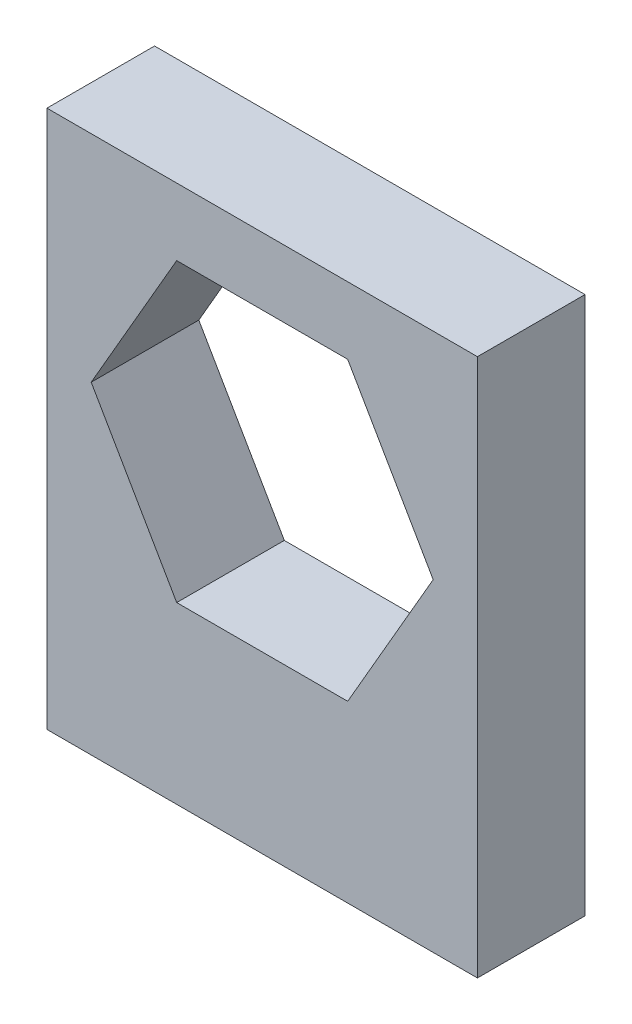
ISO-10303-21;
HEADER;
FILE_DESCRIPTION(('STEP AP214'),'2;1');
FILE_NAME('part.step','',(''),(''),'','','');
FILE_SCHEMA(('AUTOMOTIVE_DESIGN { 1 0 10303 214 1 1 1 1 }'));
ENDSEC;
DATA;
#1=APPLICATION_CONTEXT('core data for automotive mechanical design processes');
#2=APPLICATION_PROTOCOL_DEFINITION('international standard','automotive_design',2000,#1);
#3=PRODUCT_CONTEXT('',#1,'mechanical');
#4=PRODUCT('Part','Part','',(#3));
#5=PRODUCT_RELATED_PRODUCT_CATEGORY('part','',(#4));
#6=PRODUCT_DEFINITION_FORMATION('','',#4);
#7=PRODUCT_DEFINITION_CONTEXT('part definition',#1,'design');
#8=PRODUCT_DEFINITION('design','',#6,#7);
#9=PRODUCT_DEFINITION_SHAPE('','',#8);
#10=(LENGTH_UNIT() NAMED_UNIT(*) SI_UNIT(.MILLI.,.METRE.));
#11=(NAMED_UNIT(*) PLANE_ANGLE_UNIT() SI_UNIT($,.RADIAN.));
#12=(NAMED_UNIT(*) SI_UNIT($,.STERADIAN.) SOLID_ANGLE_UNIT());
#13=UNCERTAINTY_MEASURE_WITH_UNIT(LENGTH_MEASURE(1.E-05),#10,'distance_accuracy_value','');
#14=(GEOMETRIC_REPRESENTATION_CONTEXT(3) GLOBAL_UNCERTAINTY_ASSIGNED_CONTEXT((#13)) GLOBAL_UNIT_ASSIGNED_CONTEXT((#10,
#11,#12)) REPRESENTATION_CONTEXT('',''));
#15=CARTESIAN_POINT('',(0.,0.,0.));
#16=DIRECTION('',(0.,0.,1.));
#17=DIRECTION('',(1.,0.,0.));
#18=AXIS2_PLACEMENT_3D('',#15,#16,#17);
#19=CARTESIAN_POINT('',(0.,0.,1.5875));
#20=DIRECTION('',(0.,0.,1.));
#21=DIRECTION('',(1.,0.,0.));
#22=AXIS2_PLACEMENT_3D('',#19,#20,#21);
#23=PLANE('',#22);
#24=DIRECTION('',(0.,-1.,0.));
#25=VECTOR('',#24,1.);
#26=CARTESIAN_POINT('',(-6.35,6.35,1.5875));
#27=LINE('',#26,#25);
#28=CARTESIAN_POINT('',(-6.35,6.35,1.5875));
#29=VERTEX_POINT('',#28);
#30=CARTESIAN_POINT('',(-6.35,-9.525,1.5875));
#31=VERTEX_POINT('',#30);
#32=EDGE_CURVE('E161',#29,#31,#27,.T.);
#33=ORIENTED_EDGE('',*,*,#32,.T.);
#34=DIRECTION('',(1.,0.,0.));
#35=VECTOR('',#34,1.);
#36=CARTESIAN_POINT('',(-6.35,-9.525,1.5875));
#37=LINE('',#36,#35);
#38=CARTESIAN_POINT('',(6.35,-9.525,1.5875));
#39=VERTEX_POINT('',#38);
#40=EDGE_CURVE('E164',#31,#39,#37,.T.);
#41=ORIENTED_EDGE('',*,*,#40,.T.);
#42=DIRECTION('',(0.,1.,0.));
#43=VECTOR('',#42,1.);
#44=CARTESIAN_POINT('',(6.35,6.35,1.5875));
#45=LINE('',#44,#43);
#46=CARTESIAN_POINT('',(6.35,6.35,1.5875));
#47=VERTEX_POINT('',#46);
#48=EDGE_CURVE('E167',#39,#47,#45,.T.);
#49=ORIENTED_EDGE('',*,*,#48,.T.);
#50=DIRECTION('',(-1.,0.,0.));
#51=VECTOR('',#50,1.);
#52=CARTESIAN_POINT('',(-6.35,6.35,1.5875));
#53=LINE('',#52,#51);
#54=EDGE_CURVE('E169',#47,#29,#53,.T.);
#55=ORIENTED_EDGE('',*,*,#54,.T.);
#56=EDGE_LOOP('',(#33,#41,#49,#55));
#57=FACE_BOUND('',#56,.T.);
#58=DIRECTION('',(-1.,0.,0.));
#59=VECTOR('',#58,1.);
#60=CARTESIAN_POINT('',(2.52232785603563,4.3688,1.5875));
#61=LINE('',#60,#59);
#62=CARTESIAN_POINT('',(2.52232785603563,4.3688,1.5875));
#63=VERTEX_POINT('',#62);
#64=CARTESIAN_POINT('',(-2.52232785603564,4.3688,1.5875));
#65=VERTEX_POINT('',#64);
#66=EDGE_CURVE('E118',#63,#65,#61,.T.);
#67=ORIENTED_EDGE('',*,*,#66,.F.);
#68=DIRECTION('',(-0.5,0.866025403784438,0.));
#69=VECTOR('',#68,1.);
#70=CARTESIAN_POINT('',(5.04465571207127,0.,1.5875));
#71=LINE('',#70,#69);
#72=CARTESIAN_POINT('',(5.04465571207127,0.,1.5875));
#73=VERTEX_POINT('',#72);
#74=EDGE_CURVE('E110',#73,#63,#71,.T.);
#75=ORIENTED_EDGE('',*,*,#74,.F.);
#76=DIRECTION('',(0.5,0.866025403784439,0.));
#77=VECTOR('',#76,1.);
#78=CARTESIAN_POINT('',(2.52232785603564,-4.3688,1.5875));
#79=LINE('',#78,#77);
#80=CARTESIAN_POINT('',(2.52232785603564,-4.3688,1.5875));
#81=VERTEX_POINT('',#80);
#82=EDGE_CURVE('E139',#81,#73,#79,.T.);
#83=ORIENTED_EDGE('',*,*,#82,.F.);
#84=DIRECTION('',(1.,0.,0.));
#85=VECTOR('',#84,1.);
#86=CARTESIAN_POINT('',(-2.52232785603563,-4.3688,1.5875));
#87=LINE('',#86,#85);
#88=CARTESIAN_POINT('',(-2.52232785603563,-4.3688,1.5875));
#89=VERTEX_POINT('',#88);
#90=EDGE_CURVE('E137',#89,#81,#87,.T.);
#91=ORIENTED_EDGE('',*,*,#90,.F.);
#92=DIRECTION('',(0.5,-0.866025403784438,0.));
#93=VECTOR('',#92,1.);
#94=CARTESIAN_POINT('',(-5.04465571207127,0.,1.5875));
#95=LINE('',#94,#93);
#96=CARTESIAN_POINT('',(-5.04465571207127,0.,1.5875));
#97=VERTEX_POINT('',#96);
#98=EDGE_CURVE('E133',#97,#89,#95,.T.);
#99=ORIENTED_EDGE('',*,*,#98,.F.);
#100=DIRECTION('',(-0.499999999999999,-0.866025403784439,0.));
#101=VECTOR('',#100,1.);
#102=CARTESIAN_POINT('',(-2.52232785603564,4.3688,1.5875));
#103=LINE('',#102,#101);
#104=EDGE_CURVE('E131',#65,#97,#103,.T.);
#105=ORIENTED_EDGE('',*,*,#104,.F.);
#106=EDGE_LOOP('',(#67,#75,#83,#91,#99,#105));
#107=FACE_BOUND('',#106,.T.);
#108=ADVANCED_FACE('F33',(#57,#107),#23,.T.);
#109=CARTESIAN_POINT('',(0.,0.,-1.5875));
#110=DIRECTION('',(0.,0.,1.));
#111=DIRECTION('',(1.,0.,0.));
#112=AXIS2_PLACEMENT_3D('',#109,#110,#111);
#113=PLANE('',#112);
#114=DIRECTION('',(0.,-1.,0.));
#115=VECTOR('',#114,1.);
#116=CARTESIAN_POINT('',(-6.35,6.35,-1.5875));
#117=LINE('',#116,#115);
#118=CARTESIAN_POINT('',(-6.35,6.35,-1.5875));
#119=VERTEX_POINT('',#118);
#120=CARTESIAN_POINT('',(-6.35,-9.525,-1.5875));
#121=VERTEX_POINT('',#120);
#122=EDGE_CURVE('E126',#119,#121,#117,.T.);
#123=ORIENTED_EDGE('',*,*,#122,.F.);
#124=DIRECTION('',(-1.,0.,0.));
#125=VECTOR('',#124,1.);
#126=CARTESIAN_POINT('',(-6.35,6.35,-1.5875));
#127=LINE('',#126,#125);
#128=CARTESIAN_POINT('',(6.35,6.35,-1.5875));
#129=VERTEX_POINT('',#128);
#130=EDGE_CURVE('E165',#129,#119,#127,.T.);
#131=ORIENTED_EDGE('',*,*,#130,.F.);
#132=DIRECTION('',(0.,1.,0.));
#133=VECTOR('',#132,1.);
#134=CARTESIAN_POINT('',(6.35,6.35,-1.5875));
#135=LINE('',#134,#133);
#136=CARTESIAN_POINT('',(6.35,-9.525,-1.5875));
#137=VERTEX_POINT('',#136);
#138=EDGE_CURVE('E176',#137,#129,#135,.T.);
#139=ORIENTED_EDGE('',*,*,#138,.F.);
#140=DIRECTION('',(1.,0.,0.));
#141=VECTOR('',#140,1.);
#142=CARTESIAN_POINT('',(-6.35,-9.525,-1.5875));
#143=LINE('',#142,#141);
#144=EDGE_CURVE('E174',#121,#137,#143,.T.);
#145=ORIENTED_EDGE('',*,*,#144,.F.);
#146=EDGE_LOOP('',(#123,#131,#139,#145));
#147=FACE_BOUND('',#146,.T.);
#148=DIRECTION('',(-0.5,0.866025403784438,0.));
#149=VECTOR('',#148,1.);
#150=CARTESIAN_POINT('',(5.04465571207127,0.,-1.5875));
#151=LINE('',#150,#149);
#152=CARTESIAN_POINT('',(5.04465571207127,0.,-1.5875));
#153=VERTEX_POINT('',#152);
#154=CARTESIAN_POINT('',(2.52232785603563,4.3688,-1.5875));
#155=VERTEX_POINT('',#154);
#156=EDGE_CURVE('E56',#153,#155,#151,.T.);
#157=ORIENTED_EDGE('',*,*,#156,.T.);
#158=DIRECTION('',(-1.,0.,0.));
#159=VECTOR('',#158,1.);
#160=CARTESIAN_POINT('',(2.52232785603563,4.3688,-1.5875));
#161=LINE('',#160,#159);
#162=CARTESIAN_POINT('',(-2.52232785603564,4.3688,-1.5875));
#163=VERTEX_POINT('',#162);
#164=EDGE_CURVE('E125',#155,#163,#161,.T.);
#165=ORIENTED_EDGE('',*,*,#164,.T.);
#166=DIRECTION('',(-0.499999999999999,-0.866025403784439,0.));
#167=VECTOR('',#166,1.);
#168=CARTESIAN_POINT('',(-2.52232785603564,4.3688,-1.5875));
#169=LINE('',#168,#167);
#170=CARTESIAN_POINT('',(-5.04465571207127,0.,-1.5875));
#171=VERTEX_POINT('',#170);
#172=EDGE_CURVE('E143',#163,#171,#169,.T.);
#173=ORIENTED_EDGE('',*,*,#172,.T.);
#174=DIRECTION('',(0.5,-0.866025403784438,0.));
#175=VECTOR('',#174,1.);
#176=CARTESIAN_POINT('',(-5.04465571207127,0.,-1.5875));
#177=LINE('',#176,#175);
#178=CARTESIAN_POINT('',(-2.52232785603563,-4.3688,-1.5875));
#179=VERTEX_POINT('',#178);
#180=EDGE_CURVE('E146',#171,#179,#177,.T.);
#181=ORIENTED_EDGE('',*,*,#180,.T.);
#182=DIRECTION('',(1.,0.,0.));
#183=VECTOR('',#182,1.);
#184=CARTESIAN_POINT('',(-2.52232785603563,-4.3688,-1.5875));
#185=LINE('',#184,#183);
#186=CARTESIAN_POINT('',(2.52232785603564,-4.3688,-1.5875));
#187=VERTEX_POINT('',#186);
#188=EDGE_CURVE('E149',#179,#187,#185,.T.);
#189=ORIENTED_EDGE('',*,*,#188,.T.);
#190=DIRECTION('',(0.5,0.866025403784439,0.));
#191=VECTOR('',#190,1.);
#192=CARTESIAN_POINT('',(2.52232785603564,-4.3688,-1.5875));
#193=LINE('',#192,#191);
#194=EDGE_CURVE('E119',#187,#153,#193,.T.);
#195=ORIENTED_EDGE('',*,*,#194,.T.);
#196=EDGE_LOOP('',(#157,#165,#173,#181,#189,#195));
#197=FACE_BOUND('',#196,.T.);
#198=ADVANCED_FACE('F194',(#147,#197),#113,.F.);
#199=CARTESIAN_POINT('',(-6.35,6.35,1.5875));
#200=DIRECTION('',(1.,0.,0.));
#201=DIRECTION('',(0.,1.,0.));
#202=AXIS2_PLACEMENT_3D('',#199,#200,#201);
#203=PLANE('',#202);
#204=ORIENTED_EDGE('',*,*,#122,.T.);
#205=DIRECTION('',(0.,0.,-1.));
#206=VECTOR('',#205,1.);
#207=CARTESIAN_POINT('',(-6.35,-9.525,1.5875));
#208=LINE('',#207,#206);
#209=EDGE_CURVE('E11',#31,#121,#208,.T.);
#210=ORIENTED_EDGE('',*,*,#209,.F.);
#211=ORIENTED_EDGE('',*,*,#32,.F.);
#212=DIRECTION('',(0.,0.,-1.));
#213=VECTOR('',#212,1.);
#214=CARTESIAN_POINT('',(-6.35,6.35,1.5875));
#215=LINE('',#214,#213);
#216=EDGE_CURVE('E171',#29,#119,#215,.T.);
#217=ORIENTED_EDGE('',*,*,#216,.T.);
#218=EDGE_LOOP('',(#204,#210,#211,#217));
#219=FACE_BOUND('',#218,.T.);
#220=ADVANCED_FACE('F35',(#219),#203,.F.);
#221=CARTESIAN_POINT('',(-6.35,-9.525,1.5875));
#222=DIRECTION('',(0.,1.,0.));
#223=DIRECTION('',(0.,0.,1.));
#224=AXIS2_PLACEMENT_3D('',#221,#222,#223);
#225=PLANE('',#224);
#226=ORIENTED_EDGE('',*,*,#144,.T.);
#227=DIRECTION('',(0.,0.,-1.));
#228=VECTOR('',#227,1.);
#229=CARTESIAN_POINT('',(6.35,-9.525,1.5875));
#230=LINE('',#229,#228);
#231=EDGE_CURVE('E41',#39,#137,#230,.T.);
#232=ORIENTED_EDGE('',*,*,#231,.F.);
#233=ORIENTED_EDGE('',*,*,#40,.F.);
#234=ORIENTED_EDGE('',*,*,#209,.T.);
#235=EDGE_LOOP('',(#226,#232,#233,#234));
#236=FACE_BOUND('',#235,.T.);
#237=ADVANCED_FACE('F204',(#236),#225,.F.);
#238=CARTESIAN_POINT('',(6.35,6.35,1.5875));
#239=DIRECTION('',(-1.,0.,0.));
#240=DIRECTION('',(0.,-1.,0.));
#241=AXIS2_PLACEMENT_3D('',#238,#239,#240);
#242=PLANE('',#241);
#243=ORIENTED_EDGE('',*,*,#138,.T.);
#244=DIRECTION('',(0.,0.,-1.));
#245=VECTOR('',#244,1.);
#246=CARTESIAN_POINT('',(6.35,6.35,1.5875));
#247=LINE('',#246,#245);
#248=EDGE_CURVE('E181',#47,#129,#247,.T.);
#249=ORIENTED_EDGE('',*,*,#248,.F.);
#250=ORIENTED_EDGE('',*,*,#48,.F.);
#251=ORIENTED_EDGE('',*,*,#231,.T.);
#252=EDGE_LOOP('',(#243,#249,#250,#251));
#253=FACE_BOUND('',#252,.T.);
#254=ADVANCED_FACE('F188',(#253),#242,.F.);
#255=CARTESIAN_POINT('',(-6.35,6.35,1.5875));
#256=DIRECTION('',(0.,-1.,0.));
#257=DIRECTION('',(0.,0.,-1.));
#258=AXIS2_PLACEMENT_3D('',#255,#256,#257);
#259=PLANE('',#258);
#260=ORIENTED_EDGE('',*,*,#130,.T.);
#261=ORIENTED_EDGE('',*,*,#216,.F.);
#262=ORIENTED_EDGE('',*,*,#54,.F.);
#263=ORIENTED_EDGE('',*,*,#248,.T.);
#264=EDGE_LOOP('',(#260,#261,#262,#263));
#265=FACE_BOUND('',#264,.T.);
#266=ADVANCED_FACE('F198',(#265),#259,.F.);
#267=CARTESIAN_POINT('',(5.04465571207127,0.,1.5875));
#268=DIRECTION('',(-0.866025403784438,-0.5,0.));
#269=DIRECTION('',(0.500000000000001,-0.866025403784438,0.));
#270=AXIS2_PLACEMENT_3D('',#267,#268,#269);
#271=PLANE('',#270);
#272=ORIENTED_EDGE('',*,*,#156,.F.);
#273=DIRECTION('',(0.,0.,-1.));
#274=VECTOR('',#273,1.);
#275=CARTESIAN_POINT('',(5.04465571207127,0.,1.5875));
#276=LINE('',#275,#274);
#277=EDGE_CURVE('E114',#73,#153,#276,.T.);
#278=ORIENTED_EDGE('',*,*,#277,.F.);
#279=ORIENTED_EDGE('',*,*,#74,.T.);
#280=DIRECTION('',(0.,0.,-1.));
#281=VECTOR('',#280,1.);
#282=CARTESIAN_POINT('',(2.52232785603563,4.3688,1.5875));
#283=LINE('',#282,#281);
#284=EDGE_CURVE('E113',#63,#155,#283,.T.);
#285=ORIENTED_EDGE('',*,*,#284,.T.);
#286=EDGE_LOOP('',(#272,#278,#279,#285));
#287=FACE_BOUND('',#286,.T.);
#288=ADVANCED_FACE('F112',(#287),#271,.T.);
#289=CARTESIAN_POINT('',(2.52232785603563,4.3688,1.5875));
#290=DIRECTION('',(0.,-1.,0.));
#291=DIRECTION('',(0.,0.,-1.));
#292=AXIS2_PLACEMENT_3D('',#289,#290,#291);
#293=PLANE('',#292);
#294=ORIENTED_EDGE('',*,*,#164,.F.);
#295=ORIENTED_EDGE('',*,*,#284,.F.);
#296=ORIENTED_EDGE('',*,*,#66,.T.);
#297=DIRECTION('',(0.,0.,-1.));
#298=VECTOR('',#297,1.);
#299=CARTESIAN_POINT('',(-2.52232785603564,4.3688,1.5875));
#300=LINE('',#299,#298);
#301=EDGE_CURVE('E127',#65,#163,#300,.T.);
#302=ORIENTED_EDGE('',*,*,#301,.T.);
#303=EDGE_LOOP('',(#294,#295,#296,#302));
#304=FACE_BOUND('',#303,.T.);
#305=ADVANCED_FACE('F122',(#304),#293,.T.);
#306=CARTESIAN_POINT('',(-2.52232785603564,4.3688,1.5875));
#307=DIRECTION('',(0.866025403784439,-0.499999999999999,0.));
#308=DIRECTION('',(0.499999999999999,0.866025403784439,0.));
#309=AXIS2_PLACEMENT_3D('',#306,#307,#308);
#310=PLANE('',#309);
#311=ORIENTED_EDGE('',*,*,#172,.F.);
#312=ORIENTED_EDGE('',*,*,#301,.F.);
#313=ORIENTED_EDGE('',*,*,#104,.T.);
#314=DIRECTION('',(0.,0.,-1.));
#315=VECTOR('',#314,1.);
#316=CARTESIAN_POINT('',(-5.04465571207127,0.,1.5875));
#317=LINE('',#316,#315);
#318=EDGE_CURVE('E158',#97,#171,#317,.T.);
#319=ORIENTED_EDGE('',*,*,#318,.T.);
#320=EDGE_LOOP('',(#311,#312,#313,#319));
#321=FACE_BOUND('',#320,.T.);
#322=ADVANCED_FACE('F227',(#321),#310,.T.);
#323=CARTESIAN_POINT('',(-5.04465571207127,0.,1.5875));
#324=DIRECTION('',(0.866025403784438,0.5,0.));
#325=DIRECTION('',(-0.5,0.866025403784438,0.));
#326=AXIS2_PLACEMENT_3D('',#323,#324,#325);
#327=PLANE('',#326);
#328=ORIENTED_EDGE('',*,*,#180,.F.);
#329=ORIENTED_EDGE('',*,*,#318,.F.);
#330=ORIENTED_EDGE('',*,*,#98,.T.);
#331=DIRECTION('',(0.,0.,-1.));
#332=VECTOR('',#331,1.);
#333=CARTESIAN_POINT('',(-2.52232785603563,-4.3688,1.5875));
#334=LINE('',#333,#332);
#335=EDGE_CURVE('E156',#89,#179,#334,.T.);
#336=ORIENTED_EDGE('',*,*,#335,.T.);
#337=EDGE_LOOP('',(#328,#329,#330,#336));
#338=FACE_BOUND('',#337,.T.);
#339=ADVANCED_FACE('F231',(#338),#327,.T.);
#340=CARTESIAN_POINT('',(-2.52232785603563,-4.3688,1.5875));
#341=DIRECTION('',(0.,1.,0.));
#342=DIRECTION('',(-1.,0.,0.));
#343=AXIS2_PLACEMENT_3D('',#340,#341,#342);
#344=PLANE('',#343);
#345=ORIENTED_EDGE('',*,*,#188,.F.);
#346=ORIENTED_EDGE('',*,*,#335,.F.);
#347=ORIENTED_EDGE('',*,*,#90,.T.);
#348=DIRECTION('',(0.,0.,-1.));
#349=VECTOR('',#348,1.);
#350=CARTESIAN_POINT('',(2.52232785603564,-4.3688,1.5875));
#351=LINE('',#350,#349);
#352=EDGE_CURVE('E48',#81,#187,#351,.T.);
#353=ORIENTED_EDGE('',*,*,#352,.T.);
#354=EDGE_LOOP('',(#345,#346,#347,#353));
#355=FACE_BOUND('',#354,.T.);
#356=ADVANCED_FACE('F237',(#355),#344,.T.);
#357=CARTESIAN_POINT('',(2.52232785603564,-4.3688,1.5875));
#358=DIRECTION('',(-0.866025403784439,0.5,0.));
#359=DIRECTION('',(-0.5,-0.866025403784439,0.));
#360=AXIS2_PLACEMENT_3D('',#357,#358,#359);
#361=PLANE('',#360);
#362=ORIENTED_EDGE('',*,*,#194,.F.);
#363=ORIENTED_EDGE('',*,*,#352,.F.);
#364=ORIENTED_EDGE('',*,*,#82,.T.);
#365=ORIENTED_EDGE('',*,*,#277,.T.);
#366=EDGE_LOOP('',(#362,#363,#364,#365));
#367=FACE_BOUND('',#366,.T.);
#368=ADVANCED_FACE('F241',(#367),#361,.T.);
#369=CLOSED_SHELL('',(#108,#198,#220,#237,#254,#266,#288,#305,#322,#339,#356,#368));
#370=MANIFOLD_SOLID_BREP('B2',#369);
#371=ADVANCED_BREP_SHAPE_REPRESENTATION('',(#18,#370),#14);
#372=SHAPE_DEFINITION_REPRESENTATION(#9,#371);
ENDSEC;
END-ISO-10303-21;
